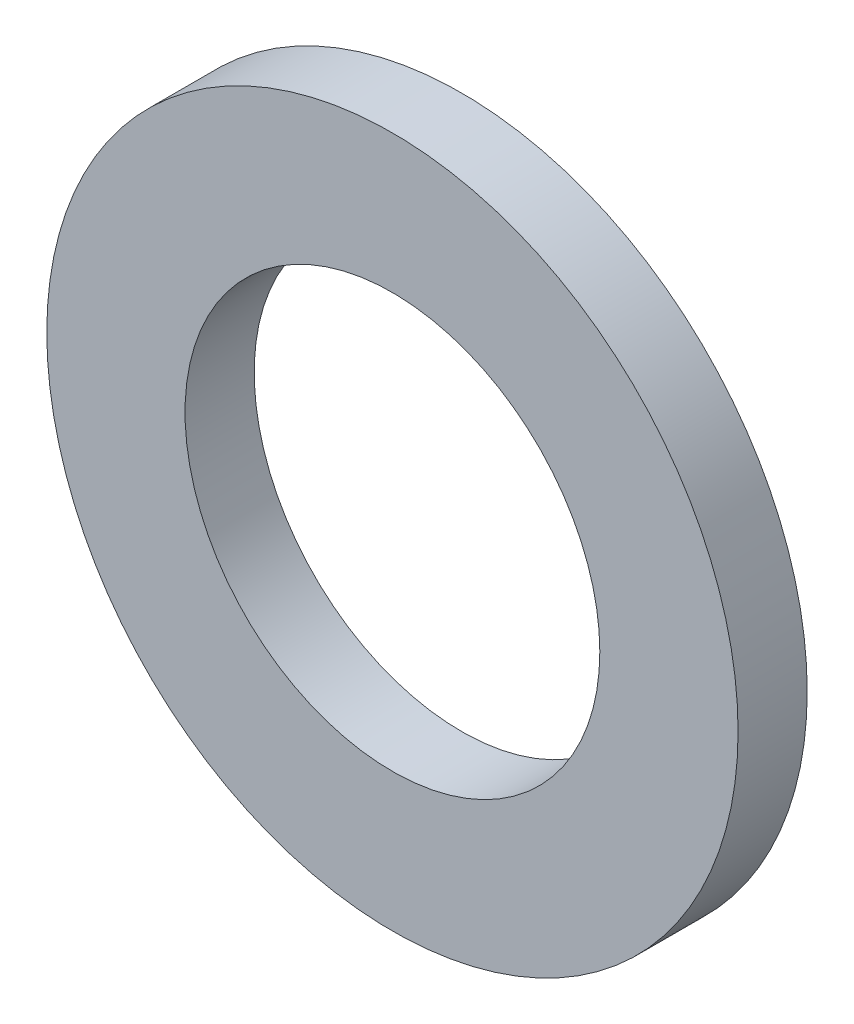
ISO-10303-21;
HEADER;
FILE_DESCRIPTION(('STEP AP214'),'2;1');
FILE_NAME('part.step','',(''),(''),'','','');
FILE_SCHEMA(('AUTOMOTIVE_DESIGN { 1 0 10303 214 1 1 1 1 }'));
ENDSEC;
DATA;
#1=APPLICATION_CONTEXT('core data for automotive mechanical design processes');
#2=APPLICATION_PROTOCOL_DEFINITION('international standard','automotive_design',2000,#1);
#3=PRODUCT_CONTEXT('',#1,'mechanical');
#4=PRODUCT('Part','Part','',(#3));
#5=PRODUCT_RELATED_PRODUCT_CATEGORY('part','',(#4));
#6=PRODUCT_DEFINITION_FORMATION('','',#4);
#7=PRODUCT_DEFINITION_CONTEXT('part definition',#1,'design');
#8=PRODUCT_DEFINITION('design','',#6,#7);
#9=PRODUCT_DEFINITION_SHAPE('','',#8);
#10=(LENGTH_UNIT() NAMED_UNIT(*) SI_UNIT(.MILLI.,.METRE.));
#11=(NAMED_UNIT(*) PLANE_ANGLE_UNIT() SI_UNIT($,.RADIAN.));
#12=(NAMED_UNIT(*) SI_UNIT($,.STERADIAN.) SOLID_ANGLE_UNIT());
#13=UNCERTAINTY_MEASURE_WITH_UNIT(LENGTH_MEASURE(1.E-05),#10,'distance_accuracy_value','');
#14=(GEOMETRIC_REPRESENTATION_CONTEXT(3) GLOBAL_UNCERTAINTY_ASSIGNED_CONTEXT((#13)) GLOBAL_UNIT_ASSIGNED_CONTEXT((#10,
#11,#12)) REPRESENTATION_CONTEXT('',''));
#15=CARTESIAN_POINT('',(0.,0.,0.));
#16=DIRECTION('',(0.,0.,1.));
#17=DIRECTION('',(1.,0.,0.));
#18=AXIS2_PLACEMENT_3D('',#15,#16,#17);
#19=CARTESIAN_POINT('',(0.,0.,1.5875));
#20=DIRECTION('',(0.,0.,1.));
#21=DIRECTION('',(1.,0.,0.));
#22=AXIS2_PLACEMENT_3D('',#19,#20,#21);
#23=PLANE('',#22);
#24=CARTESIAN_POINT('',(0.,0.,1.5875));
#25=DIRECTION('',(0.,0.,1.));
#26=DIRECTION('',(1.,0.,0.));
#27=AXIS2_PLACEMENT_3D('',#24,#25,#26);
#28=CIRCLE('',#27,7.9375);
#29=CARTESIAN_POINT('',(7.9375,0.,1.5875));
#30=VERTEX_POINT('',#29);
#31=EDGE_CURVE('E10',#30,#30,#28,.T.);
#32=ORIENTED_EDGE('',*,*,#31,.T.);
#33=EDGE_LOOP('',(#32));
#34=FACE_BOUND('',#33,.T.);
#35=CARTESIAN_POINT('',(0.,0.,1.5875));
#36=DIRECTION('',(0.,0.,1.));
#37=DIRECTION('',(1.,0.,0.));
#38=AXIS2_PLACEMENT_3D('',#35,#36,#37);
#39=CIRCLE('',#38,4.7625);
#40=CARTESIAN_POINT('',(4.7625,0.,1.5875));
#41=VERTEX_POINT('',#40);
#42=EDGE_CURVE('E41',#41,#41,#39,.T.);
#43=ORIENTED_EDGE('',*,*,#42,.F.);
#44=EDGE_LOOP('',(#43));
#45=FACE_BOUND('',#44,.T.);
#46=ADVANCED_FACE('F30',(#34,#45),#23,.T.);
#47=CARTESIAN_POINT('',(0.,0.,0.));
#48=DIRECTION('',(0.,0.,1.));
#49=DIRECTION('',(1.,0.,0.));
#50=AXIS2_PLACEMENT_3D('',#47,#48,#49);
#51=PLANE('',#50);
#52=CARTESIAN_POINT('',(0.,0.,0.));
#53=DIRECTION('',(0.,0.,1.));
#54=DIRECTION('',(1.,0.,0.));
#55=AXIS2_PLACEMENT_3D('',#52,#53,#54);
#56=CIRCLE('',#55,7.9375);
#57=CARTESIAN_POINT('',(7.9375,0.,0.));
#58=VERTEX_POINT('',#57);
#59=EDGE_CURVE('E34',#58,#58,#56,.T.);
#60=ORIENTED_EDGE('',*,*,#59,.F.);
#61=EDGE_LOOP('',(#60));
#62=FACE_BOUND('',#61,.T.);
#63=CARTESIAN_POINT('',(0.,0.,0.));
#64=DIRECTION('',(0.,0.,1.));
#65=DIRECTION('',(1.,0.,0.));
#66=AXIS2_PLACEMENT_3D('',#63,#64,#65);
#67=CIRCLE('',#66,4.7625);
#68=CARTESIAN_POINT('',(4.7625,0.,0.));
#69=VERTEX_POINT('',#68);
#70=EDGE_CURVE('E43',#69,#69,#67,.T.);
#71=ORIENTED_EDGE('',*,*,#70,.T.);
#72=EDGE_LOOP('',(#71));
#73=FACE_BOUND('',#72,.T.);
#74=ADVANCED_FACE('F53',(#62,#73),#51,.F.);
#75=CARTESIAN_POINT('',(0.,0.,1.5875));
#76=DIRECTION('',(0.,0.,-1.));
#77=DIRECTION('',(-1.,0.,0.));
#78=AXIS2_PLACEMENT_3D('',#75,#76,#77);
#79=CYLINDRICAL_SURFACE('',#78,7.9375);
#80=ORIENTED_EDGE('',*,*,#31,.F.);
#81=EDGE_LOOP('',(#80));
#82=FACE_BOUND('',#81,.T.);
#83=ORIENTED_EDGE('',*,*,#59,.T.);
#84=EDGE_LOOP('',(#83));
#85=FACE_BOUND('',#84,.T.);
#86=ADVANCED_FACE('F32',(#82,#85),#79,.T.);
#87=CARTESIAN_POINT('',(0.,0.,1.5875));
#88=DIRECTION('',(0.,0.,-1.));
#89=DIRECTION('',(-1.,0.,0.));
#90=AXIS2_PLACEMENT_3D('',#87,#88,#89);
#91=CYLINDRICAL_SURFACE('',#90,4.7625);
#92=ORIENTED_EDGE('',*,*,#42,.T.);
#93=EDGE_LOOP('',(#92));
#94=FACE_BOUND('',#93,.T.);
#95=ORIENTED_EDGE('',*,*,#70,.F.);
#96=EDGE_LOOP('',(#95));
#97=FACE_BOUND('',#96,.T.);
#98=ADVANCED_FACE('F49',(#94,#97),#91,.F.);
#99=CLOSED_SHELL('',(#46,#74,#86,#98));
#100=MANIFOLD_SOLID_BREP('B2',#99);
#101=ADVANCED_BREP_SHAPE_REPRESENTATION('',(#18,#100),#14);
#102=SHAPE_DEFINITION_REPRESENTATION(#9,#101);
ENDSEC;
END-ISO-10303-21;
